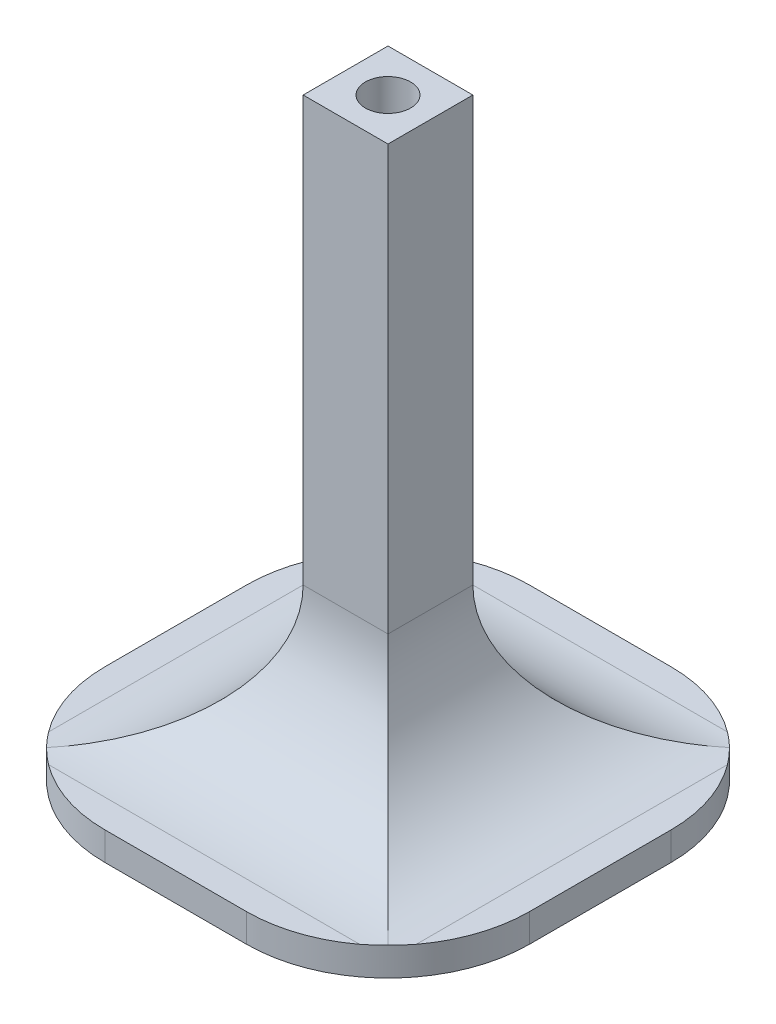
ISO-10303-21;
HEADER;
FILE_DESCRIPTION(('STEP AP214'),'2;1');
FILE_NAME('part.step','',(''),(''),'','','');
FILE_SCHEMA(('AUTOMOTIVE_DESIGN { 1 0 10303 214 1 1 1 1 }'));
ENDSEC;
DATA;
#1=APPLICATION_CONTEXT('core data for automotive mechanical design processes');
#2=APPLICATION_PROTOCOL_DEFINITION('international standard','automotive_design',2000,#1);
#3=PRODUCT_CONTEXT('',#1,'mechanical');
#4=PRODUCT('Part','Part','',(#3));
#5=PRODUCT_RELATED_PRODUCT_CATEGORY('part','',(#4));
#6=PRODUCT_DEFINITION_FORMATION('','',#4);
#7=PRODUCT_DEFINITION_CONTEXT('part definition',#1,'design');
#8=PRODUCT_DEFINITION('design','',#6,#7);
#9=PRODUCT_DEFINITION_SHAPE('','',#8);
#10=(LENGTH_UNIT() NAMED_UNIT(*) SI_UNIT(.MILLI.,.METRE.));
#11=(NAMED_UNIT(*) PLANE_ANGLE_UNIT() SI_UNIT($,.RADIAN.));
#12=(NAMED_UNIT(*) SI_UNIT($,.STERADIAN.) SOLID_ANGLE_UNIT());
#13=UNCERTAINTY_MEASURE_WITH_UNIT(LENGTH_MEASURE(1.E-05),#10,'distance_accuracy_value','');
#14=(GEOMETRIC_REPRESENTATION_CONTEXT(3) GLOBAL_UNCERTAINTY_ASSIGNED_CONTEXT((#13)) GLOBAL_UNIT_ASSIGNED_CONTEXT((#10,
#11,#12)) REPRESENTATION_CONTEXT('',''));
#15=CARTESIAN_POINT('',(0.,0.,0.));
#16=DIRECTION('',(0.,0.,1.));
#17=DIRECTION('',(1.,0.,0.));
#18=AXIS2_PLACEMENT_3D('',#15,#16,#17);
#19=CARTESIAN_POINT('',(0.,2.,0.));
#20=DIRECTION('',(0.,-1.,0.));
#21=DIRECTION('',(0.,0.,-1.));
#22=AXIS2_PLACEMENT_3D('',#19,#20,#21);
#23=PLANE('',#22);
#24=DIRECTION('',(0.,0.,-1.));
#25=VECTOR('',#24,1.);
#26=CARTESIAN_POINT('',(28.,2.,-12.));
#27=LINE('',#26,#25);
#28=CARTESIAN_POINT('',(28.,2.,-26.));
#29=VERTEX_POINT('',#28);
#30=CARTESIAN_POINT('',(28.,2.,-4.00000000000001));
#31=VERTEX_POINT('',#30);
#32=EDGE_CURVE('E303',#29,#31,#27,.F.);
#33=ORIENTED_EDGE('',*,*,#32,.T.);
#34=CARTESIAN_POINT('',(20.,2.,-10.));
#35=DIRECTION('',(0.,-1.,0.));
#36=DIRECTION('',(0.,0.,-1.));
#37=AXIS2_PLACEMENT_3D('',#34,#35,#36);
#38=CIRCLE('',#37,10.);
#39=CARTESIAN_POINT('',(30.,2.,-10.));
#40=VERTEX_POINT('',#39);
#41=EDGE_CURVE('E281',#31,#40,#38,.F.);
#42=ORIENTED_EDGE('',*,*,#41,.T.);
#43=DIRECTION('',(0.,0.,-1.));
#44=VECTOR('',#43,1.);
#45=CARTESIAN_POINT('',(30.,2.,0.));
#46=LINE('',#45,#44);
#47=CARTESIAN_POINT('',(30.,2.,-20.));
#48=VERTEX_POINT('',#47);
#49=EDGE_CURVE('E221',#40,#48,#46,.T.);
#50=ORIENTED_EDGE('',*,*,#49,.T.);
#51=CARTESIAN_POINT('',(20.,2.,-20.));
#52=DIRECTION('',(0.,-1.,0.));
#53=DIRECTION('',(0.,0.,-1.));
#54=AXIS2_PLACEMENT_3D('',#51,#52,#53);
#55=CIRCLE('',#54,10.);
#56=EDGE_CURVE('E297',#48,#29,#55,.F.);
#57=ORIENTED_EDGE('',*,*,#56,.T.);
#58=EDGE_LOOP('',(#33,#42,#50,#57));
#59=FACE_BOUND('',#58,.T.);
#60=ADVANCED_FACE('F39',(#59),#23,.F.);
#61=CARTESIAN_POINT('',(20.,2.,0.));
#62=VERTEX_POINT('',#61);
#63=CARTESIAN_POINT('',(26.,2.,-2.));
#64=VERTEX_POINT('',#63);
#65=EDGE_CURVE('E282',#62,#64,#38,.F.);
#66=ORIENTED_EDGE('',*,*,#65,.T.);
#67=DIRECTION('',(1.,0.,0.));
#68=VECTOR('',#67,1.);
#69=CARTESIAN_POINT('',(2.,2.,-2.));
#70=LINE('',#69,#68);
#71=CARTESIAN_POINT('',(3.99999999999999,2.,-2.));
#72=VERTEX_POINT('',#71);
#73=EDGE_CURVE('E478',#64,#72,#70,.F.);
#74=ORIENTED_EDGE('',*,*,#73,.T.);
#75=CARTESIAN_POINT('',(10.,2.,-10.));
#76=DIRECTION('',(0.,-1.,0.));
#77=DIRECTION('',(0.,0.,-1.));
#78=AXIS2_PLACEMENT_3D('',#75,#76,#77);
#79=CIRCLE('',#78,10.);
#80=CARTESIAN_POINT('',(10.,2.,0.));
#81=VERTEX_POINT('',#80);
#82=EDGE_CURVE('E249',#72,#81,#79,.F.);
#83=ORIENTED_EDGE('',*,*,#82,.T.);
#84=DIRECTION('',(1.,0.,0.));
#85=VECTOR('',#84,1.);
#86=CARTESIAN_POINT('',(0.,2.,0.));
#87=LINE('',#86,#85);
#88=EDGE_CURVE('E216',#81,#62,#87,.T.);
#89=ORIENTED_EDGE('',*,*,#88,.T.);
#90=EDGE_LOOP('',(#66,#74,#83,#89));
#91=FACE_BOUND('',#90,.T.);
#92=ADVANCED_FACE('F460',(#91),#23,.F.);
#93=CARTESIAN_POINT('',(0.,2.,-10.));
#94=VERTEX_POINT('',#93);
#95=CARTESIAN_POINT('',(2.,2.,-4.));
#96=VERTEX_POINT('',#95);
#97=EDGE_CURVE('E250',#94,#96,#79,.F.);
#98=ORIENTED_EDGE('',*,*,#97,.T.);
#99=DIRECTION('',(0.,0.,1.));
#100=VECTOR('',#99,1.);
#101=CARTESIAN_POINT('',(2.,2.,-18.));
#102=LINE('',#101,#100);
#103=CARTESIAN_POINT('',(2.,2.,-26.));
#104=VERTEX_POINT('',#103);
#105=EDGE_CURVE('E310',#96,#104,#102,.F.);
#106=ORIENTED_EDGE('',*,*,#105,.T.);
#107=CARTESIAN_POINT('',(10.,2.,-20.));
#108=DIRECTION('',(0.,-1.,0.));
#109=DIRECTION('',(0.,0.,-1.));
#110=AXIS2_PLACEMENT_3D('',#107,#108,#109);
#111=CIRCLE('',#110,10.);
#112=CARTESIAN_POINT('',(0.,2.,-20.));
#113=VERTEX_POINT('',#112);
#114=EDGE_CURVE('E266',#104,#113,#111,.F.);
#115=ORIENTED_EDGE('',*,*,#114,.T.);
#116=DIRECTION('',(0.,0.,1.));
#117=VECTOR('',#116,1.);
#118=CARTESIAN_POINT('',(0.,2.,0.));
#119=LINE('',#118,#117);
#120=EDGE_CURVE('E213',#113,#94,#119,.T.);
#121=ORIENTED_EDGE('',*,*,#120,.T.);
#122=EDGE_LOOP('',(#98,#106,#115,#121));
#123=FACE_BOUND('',#122,.T.);
#124=ADVANCED_FACE('F432',(#123),#23,.F.);
#125=CARTESIAN_POINT('',(10.,2.,-30.));
#126=VERTEX_POINT('',#125);
#127=CARTESIAN_POINT('',(4.00000000000001,2.,-28.));
#128=VERTEX_POINT('',#127);
#129=EDGE_CURVE('E267',#126,#128,#111,.F.);
#130=ORIENTED_EDGE('',*,*,#129,.T.);
#131=DIRECTION('',(-1.,0.,0.));
#132=VECTOR('',#131,1.);
#133=CARTESIAN_POINT('',(28.,2.,-28.));
#134=LINE('',#133,#132);
#135=CARTESIAN_POINT('',(26.,2.,-28.));
#136=VERTEX_POINT('',#135);
#137=EDGE_CURVE('E316',#128,#136,#134,.F.);
#138=ORIENTED_EDGE('',*,*,#137,.T.);
#139=CARTESIAN_POINT('',(20.,2.,-30.));
#140=VERTEX_POINT('',#139);
#141=EDGE_CURVE('E296',#136,#140,#55,.F.);
#142=ORIENTED_EDGE('',*,*,#141,.T.);
#143=DIRECTION('',(-1.,0.,0.));
#144=VECTOR('',#143,1.);
#145=CARTESIAN_POINT('',(0.,2.,-30.));
#146=LINE('',#145,#144);
#147=EDGE_CURVE('E225',#140,#126,#146,.T.);
#148=ORIENTED_EDGE('',*,*,#147,.T.);
#149=EDGE_LOOP('',(#130,#138,#142,#148));
#150=FACE_BOUND('',#149,.T.);
#151=ADVANCED_FACE('F413',(#150),#23,.F.);
#152=CARTESIAN_POINT('',(0.,2.,0.));
#153=DIRECTION('',(1.,0.,0.));
#154=DIRECTION('',(0.,0.,-1.));
#155=AXIS2_PLACEMENT_3D('',#152,#153,#154);
#156=PLANE('',#155);
#157=ORIENTED_EDGE('',*,*,#120,.F.);
#158=DIRECTION('',(0.,-1.,0.));
#159=VECTOR('',#158,1.);
#160=CARTESIAN_POINT('',(0.,2.,-20.));
#161=LINE('',#160,#159);
#162=CARTESIAN_POINT('',(0.,0.,-20.));
#163=VERTEX_POINT('',#162);
#164=EDGE_CURVE('E254',#113,#163,#161,.T.);
#165=ORIENTED_EDGE('',*,*,#164,.T.);
#166=DIRECTION('',(0.,0.,1.));
#167=VECTOR('',#166,1.);
#168=CARTESIAN_POINT('',(0.,0.,0.));
#169=LINE('',#168,#167);
#170=CARTESIAN_POINT('',(0.,0.,-10.));
#171=VERTEX_POINT('',#170);
#172=EDGE_CURVE('E203',#163,#171,#169,.T.);
#173=ORIENTED_EDGE('',*,*,#172,.T.);
#174=DIRECTION('',(0.,-1.,0.));
#175=VECTOR('',#174,1.);
#176=CARTESIAN_POINT('',(0.,2.,-10.));
#177=LINE('',#176,#175);
#178=EDGE_CURVE('E245',#171,#94,#177,.F.);
#179=ORIENTED_EDGE('',*,*,#178,.T.);
#180=EDGE_LOOP('',(#157,#165,#173,#179));
#181=FACE_BOUND('',#180,.T.);
#182=ADVANCED_FACE('F408',(#181),#156,.F.);
#183=CARTESIAN_POINT('',(0.,2.,0.));
#184=DIRECTION('',(0.,0.,-1.));
#185=DIRECTION('',(-1.,0.,0.));
#186=AXIS2_PLACEMENT_3D('',#183,#184,#185);
#187=PLANE('',#186);
#188=DIRECTION('',(1.,0.,0.));
#189=VECTOR('',#188,1.);
#190=CARTESIAN_POINT('',(0.,0.,0.));
#191=LINE('',#190,#189);
#192=CARTESIAN_POINT('',(10.,0.,0.));
#193=VERTEX_POINT('',#192);
#194=CARTESIAN_POINT('',(20.,0.,0.));
#195=VERTEX_POINT('',#194);
#196=EDGE_CURVE('E207',#193,#195,#191,.T.);
#197=ORIENTED_EDGE('',*,*,#196,.T.);
#198=DIRECTION('',(0.,-1.,0.));
#199=VECTOR('',#198,1.);
#200=CARTESIAN_POINT('',(20.,2.,0.));
#201=LINE('',#200,#199);
#202=EDGE_CURVE('E278',#195,#62,#201,.F.);
#203=ORIENTED_EDGE('',*,*,#202,.T.);
#204=ORIENTED_EDGE('',*,*,#88,.F.);
#205=DIRECTION('',(0.,-1.,0.));
#206=VECTOR('',#205,1.);
#207=CARTESIAN_POINT('',(10.,2.,0.));
#208=LINE('',#207,#206);
#209=EDGE_CURVE('E227',#81,#193,#208,.T.);
#210=ORIENTED_EDGE('',*,*,#209,.T.);
#211=EDGE_LOOP('',(#197,#203,#204,#210));
#212=FACE_BOUND('',#211,.T.);
#213=ADVANCED_FACE('F412',(#212),#187,.F.);
#214=CARTESIAN_POINT('',(30.,2.,0.));
#215=DIRECTION('',(-1.,0.,0.));
#216=DIRECTION('',(0.,0.,1.));
#217=AXIS2_PLACEMENT_3D('',#214,#215,#216);
#218=PLANE('',#217);
#219=DIRECTION('',(0.,0.,-1.));
#220=VECTOR('',#219,1.);
#221=CARTESIAN_POINT('',(30.,0.,0.));
#222=LINE('',#221,#220);
#223=CARTESIAN_POINT('',(30.,0.,-10.));
#224=VERTEX_POINT('',#223);
#225=CARTESIAN_POINT('',(30.,0.,-20.));
#226=VERTEX_POINT('',#225);
#227=EDGE_CURVE('E232',#224,#226,#222,.T.);
#228=ORIENTED_EDGE('',*,*,#227,.T.);
#229=DIRECTION('',(0.,-1.,0.));
#230=VECTOR('',#229,1.);
#231=CARTESIAN_POINT('',(30.,2.,-20.));
#232=LINE('',#231,#230);
#233=EDGE_CURVE('E293',#226,#48,#232,.F.);
#234=ORIENTED_EDGE('',*,*,#233,.T.);
#235=ORIENTED_EDGE('',*,*,#49,.F.);
#236=DIRECTION('',(0.,-1.,0.));
#237=VECTOR('',#236,1.);
#238=CARTESIAN_POINT('',(30.,2.,-10.));
#239=LINE('',#238,#237);
#240=EDGE_CURVE('E271',#40,#224,#239,.T.);
#241=ORIENTED_EDGE('',*,*,#240,.T.);
#242=EDGE_LOOP('',(#228,#234,#235,#241));
#243=FACE_BOUND('',#242,.T.);
#244=ADVANCED_FACE('F417',(#243),#218,.F.);
#245=CARTESIAN_POINT('',(0.,2.,-30.));
#246=DIRECTION('',(0.,0.,1.));
#247=DIRECTION('',(1.,0.,0.));
#248=AXIS2_PLACEMENT_3D('',#245,#246,#247);
#249=PLANE('',#248);
#250=ORIENTED_EDGE('',*,*,#147,.F.);
#251=DIRECTION('',(0.,-1.,0.));
#252=VECTOR('',#251,1.);
#253=CARTESIAN_POINT('',(20.,2.,-30.));
#254=LINE('',#253,#252);
#255=CARTESIAN_POINT('',(20.,0.,-30.));
#256=VERTEX_POINT('',#255);
#257=EDGE_CURVE('E286',#140,#256,#254,.T.);
#258=ORIENTED_EDGE('',*,*,#257,.T.);
#259=DIRECTION('',(-1.,0.,0.));
#260=VECTOR('',#259,1.);
#261=CARTESIAN_POINT('',(0.,0.,-30.));
#262=LINE('',#261,#260);
#263=CARTESIAN_POINT('',(10.,0.,-30.));
#264=VERTEX_POINT('',#263);
#265=EDGE_CURVE('E217',#256,#264,#262,.T.);
#266=ORIENTED_EDGE('',*,*,#265,.T.);
#267=DIRECTION('',(0.,-1.,0.));
#268=VECTOR('',#267,1.);
#269=CARTESIAN_POINT('',(10.,2.,-30.));
#270=LINE('',#269,#268);
#271=EDGE_CURVE('E262',#264,#126,#270,.F.);
#272=ORIENTED_EDGE('',*,*,#271,.T.);
#273=EDGE_LOOP('',(#250,#258,#266,#272));
#274=FACE_BOUND('',#273,.T.);
#275=ADVANCED_FACE('F421',(#274),#249,.F.);
#276=CARTESIAN_POINT('',(0.,0.,0.));
#277=DIRECTION('',(0.,-1.,0.));
#278=DIRECTION('',(0.,0.,-1.));
#279=AXIS2_PLACEMENT_3D('',#276,#277,#278);
#280=PLANE('',#279);
#281=ORIENTED_EDGE('',*,*,#265,.F.);
#282=CARTESIAN_POINT('',(20.,0.,-20.));
#283=DIRECTION('',(0.,-1.,0.));
#284=DIRECTION('',(0.,0.,-1.));
#285=AXIS2_PLACEMENT_3D('',#282,#283,#284);
#286=CIRCLE('',#285,10.);
#287=EDGE_CURVE('E290',#256,#226,#286,.T.);
#288=ORIENTED_EDGE('',*,*,#287,.T.);
#289=ORIENTED_EDGE('',*,*,#227,.F.);
#290=CARTESIAN_POINT('',(20.,0.,-10.));
#291=DIRECTION('',(0.,-1.,0.));
#292=DIRECTION('',(0.,0.,-1.));
#293=AXIS2_PLACEMENT_3D('',#290,#291,#292);
#294=CIRCLE('',#293,10.);
#295=EDGE_CURVE('E275',#224,#195,#294,.T.);
#296=ORIENTED_EDGE('',*,*,#295,.T.);
#297=ORIENTED_EDGE('',*,*,#196,.F.);
#298=CARTESIAN_POINT('',(10.,0.,-10.));
#299=DIRECTION('',(0.,-1.,0.));
#300=DIRECTION('',(0.,0.,-1.));
#301=AXIS2_PLACEMENT_3D('',#298,#299,#300);
#302=CIRCLE('',#301,10.);
#303=EDGE_CURVE('E241',#193,#171,#302,.T.);
#304=ORIENTED_EDGE('',*,*,#303,.T.);
#305=ORIENTED_EDGE('',*,*,#172,.F.);
#306=CARTESIAN_POINT('',(10.,0.,-20.));
#307=DIRECTION('',(0.,-1.,0.));
#308=DIRECTION('',(0.,0.,-1.));
#309=AXIS2_PLACEMENT_3D('',#306,#307,#308);
#310=CIRCLE('',#309,10.);
#311=EDGE_CURVE('E258',#163,#264,#310,.T.);
#312=ORIENTED_EDGE('',*,*,#311,.T.);
#313=EDGE_LOOP('',(#281,#288,#289,#296,#297,#304,#305,#312));
#314=FACE_BOUND('',#313,.T.);
#315=ADVANCED_FACE('F425',(#314),#280,.T.);
#316=CARTESIAN_POINT('',(18.,42.,-12.));
#317=DIRECTION('',(-1.,0.,0.));
#318=DIRECTION('',(0.,0.,1.));
#319=AXIS2_PLACEMENT_3D('',#316,#317,#318);
#320=PLANE('',#319);
#321=DIRECTION('',(0.,-1.,0.));
#322=VECTOR('',#321,1.);
#323=CARTESIAN_POINT('',(18.,42.,-12.));
#324=LINE('',#323,#322);
#325=CARTESIAN_POINT('',(18.,42.,-12.));
#326=VERTEX_POINT('',#325);
#327=CARTESIAN_POINT('',(18.,12.,-12.));
#328=VERTEX_POINT('',#327);
#329=EDGE_CURVE('E495',#326,#328,#324,.T.);
#330=ORIENTED_EDGE('',*,*,#329,.T.);
#331=DIRECTION('',(0.,0.,-1.));
#332=VECTOR('',#331,1.);
#333=CARTESIAN_POINT('',(18.,12.,-18.));
#334=LINE('',#333,#332);
#335=CARTESIAN_POINT('',(18.,12.,-18.));
#336=VERTEX_POINT('',#335);
#337=EDGE_CURVE('E201',#328,#336,#334,.T.);
#338=ORIENTED_EDGE('',*,*,#337,.T.);
#339=DIRECTION('',(0.,-1.,0.));
#340=VECTOR('',#339,1.);
#341=CARTESIAN_POINT('',(18.,42.,-18.));
#342=LINE('',#341,#340);
#343=CARTESIAN_POINT('',(18.,42.,-18.));
#344=VERTEX_POINT('',#343);
#345=EDGE_CURVE('E179',#344,#336,#342,.T.);
#346=ORIENTED_EDGE('',*,*,#345,.F.);
#347=DIRECTION('',(0.,0.,-1.));
#348=VECTOR('',#347,1.);
#349=CARTESIAN_POINT('',(18.,42.,-12.));
#350=LINE('',#349,#348);
#351=EDGE_CURVE('E187',#326,#344,#350,.T.);
#352=ORIENTED_EDGE('',*,*,#351,.F.);
#353=EDGE_LOOP('',(#330,#338,#346,#352));
#354=FACE_BOUND('',#353,.T.);
#355=ADVANCED_FACE('F200',(#354),#320,.F.);
#356=CARTESIAN_POINT('',(12.,42.,-18.));
#357=DIRECTION('',(0.,0.,1.));
#358=DIRECTION('',(1.,0.,0.));
#359=AXIS2_PLACEMENT_3D('',#356,#357,#358);
#360=PLANE('',#359);
#361=ORIENTED_EDGE('',*,*,#345,.T.);
#362=DIRECTION('',(-1.,0.,0.));
#363=VECTOR('',#362,1.);
#364=CARTESIAN_POINT('',(2.,12.,-18.));
#365=LINE('',#364,#363);
#366=CARTESIAN_POINT('',(12.,12.,-18.));
#367=VERTEX_POINT('',#366);
#368=EDGE_CURVE('E313',#336,#367,#365,.T.);
#369=ORIENTED_EDGE('',*,*,#368,.T.);
#370=DIRECTION('',(0.,-1.,0.));
#371=VECTOR('',#370,1.);
#372=CARTESIAN_POINT('',(12.,42.,-18.));
#373=LINE('',#372,#371);
#374=CARTESIAN_POINT('',(12.,42.,-18.));
#375=VERTEX_POINT('',#374);
#376=EDGE_CURVE('E182',#375,#367,#373,.T.);
#377=ORIENTED_EDGE('',*,*,#376,.F.);
#378=DIRECTION('',(-1.,0.,0.));
#379=VECTOR('',#378,1.);
#380=CARTESIAN_POINT('',(12.,42.,-18.));
#381=LINE('',#380,#379);
#382=EDGE_CURVE('E174',#344,#375,#381,.T.);
#383=ORIENTED_EDGE('',*,*,#382,.F.);
#384=EDGE_LOOP('',(#361,#369,#377,#383));
#385=FACE_BOUND('',#384,.T.);
#386=ADVANCED_FACE('F176',(#385),#360,.F.);
#387=CARTESIAN_POINT('',(12.,42.,-12.));
#388=DIRECTION('',(1.,0.,0.));
#389=DIRECTION('',(0.,0.,-1.));
#390=AXIS2_PLACEMENT_3D('',#387,#388,#389);
#391=PLANE('',#390);
#392=ORIENTED_EDGE('',*,*,#376,.T.);
#393=DIRECTION('',(0.,0.,1.));
#394=VECTOR('',#393,1.);
#395=CARTESIAN_POINT('',(12.,12.,-12.));
#396=LINE('',#395,#394);
#397=CARTESIAN_POINT('',(12.,12.,-12.));
#398=VERTEX_POINT('',#397);
#399=EDGE_CURVE('E306',#367,#398,#396,.T.);
#400=ORIENTED_EDGE('',*,*,#399,.T.);
#401=DIRECTION('',(0.,-1.,0.));
#402=VECTOR('',#401,1.);
#403=CARTESIAN_POINT('',(12.,42.,-12.));
#404=LINE('',#403,#402);
#405=CARTESIAN_POINT('',(12.,42.,-12.));
#406=VERTEX_POINT('',#405);
#407=EDGE_CURVE('E209',#406,#398,#404,.T.);
#408=ORIENTED_EDGE('',*,*,#407,.F.);
#409=DIRECTION('',(0.,0.,1.));
#410=VECTOR('',#409,1.);
#411=CARTESIAN_POINT('',(12.,42.,-12.));
#412=LINE('',#411,#410);
#413=EDGE_CURVE('E186',#375,#406,#412,.T.);
#414=ORIENTED_EDGE('',*,*,#413,.F.);
#415=EDGE_LOOP('',(#392,#400,#408,#414));
#416=FACE_BOUND('',#415,.T.);
#417=ADVANCED_FACE('F438',(#416),#391,.F.);
#418=CARTESIAN_POINT('',(12.,42.,-12.));
#419=DIRECTION('',(0.,0.,-1.));
#420=DIRECTION('',(-1.,0.,0.));
#421=AXIS2_PLACEMENT_3D('',#418,#419,#420);
#422=PLANE('',#421);
#423=ORIENTED_EDGE('',*,*,#407,.T.);
#424=DIRECTION('',(1.,0.,0.));
#425=VECTOR('',#424,1.);
#426=CARTESIAN_POINT('',(28.,12.,-12.));
#427=LINE('',#426,#425);
#428=EDGE_CURVE('E371',#398,#328,#427,.T.);
#429=ORIENTED_EDGE('',*,*,#428,.T.);
#430=ORIENTED_EDGE('',*,*,#329,.F.);
#431=DIRECTION('',(1.,0.,0.));
#432=VECTOR('',#431,1.);
#433=CARTESIAN_POINT('',(12.,42.,-12.));
#434=LINE('',#433,#432);
#435=EDGE_CURVE('E192',#406,#326,#434,.T.);
#436=ORIENTED_EDGE('',*,*,#435,.F.);
#437=EDGE_LOOP('',(#423,#429,#430,#436));
#438=FACE_BOUND('',#437,.T.);
#439=ADVANCED_FACE('F441',(#438),#422,.F.);
#440=CARTESIAN_POINT('',(0.,42.,0.));
#441=DIRECTION('',(0.,-1.,0.));
#442=DIRECTION('',(0.,0.,-1.));
#443=AXIS2_PLACEMENT_3D('',#440,#441,#442);
#444=PLANE('',#443);
#445=CARTESIAN_POINT('',(15.,42.,-15.));
#446=DIRECTION('',(0.,1.,0.));
#447=DIRECTION('',(0.,0.,1.));
#448=AXIS2_PLACEMENT_3D('',#445,#446,#447);
#449=CIRCLE('',#448,1.6);
#450=CARTESIAN_POINT('',(15.,42.,-13.4));
#451=VERTEX_POINT('',#450);
#452=EDGE_CURVE('E521',#451,#451,#449,.T.);
#453=ORIENTED_EDGE('',*,*,#452,.F.);
#454=EDGE_LOOP('',(#453));
#455=FACE_BOUND('',#454,.T.);
#456=ORIENTED_EDGE('',*,*,#351,.T.);
#457=ORIENTED_EDGE('',*,*,#382,.T.);
#458=ORIENTED_EDGE('',*,*,#413,.T.);
#459=ORIENTED_EDGE('',*,*,#435,.T.);
#460=EDGE_LOOP('',(#456,#457,#458,#459));
#461=FACE_BOUND('',#460,.T.);
#462=ADVANCED_FACE('F190',(#455,#461),#444,.F.);
#463=CARTESIAN_POINT('',(10.,2.,-10.));
#464=DIRECTION('',(0.,-1.,0.));
#465=DIRECTION('',(0.,0.,-1.));
#466=AXIS2_PLACEMENT_3D('',#463,#464,#465);
#467=CYLINDRICAL_SURFACE('',#466,10.);
#468=ORIENTED_EDGE('',*,*,#97,.F.);
#469=ORIENTED_EDGE('',*,*,#178,.F.);
#470=ORIENTED_EDGE('',*,*,#303,.F.);
#471=ORIENTED_EDGE('',*,*,#209,.F.);
#472=ORIENTED_EDGE('',*,*,#82,.F.);
#473=CARTESIAN_POINT('',(3.99999999999999,2.,-2.));
#474=CARTESIAN_POINT('',(3.81281477685043,2.00000392128931,-2.14035542208783));
#475=CARTESIAN_POINT('',(3.63054897202106,2.00295596237277,-2.28735293146828));
#476=CARTESIAN_POINT('',(3.2780510543001,2.01641216405951,-2.59261894314296));
#477=CARTESIAN_POINT('',(3.10774968813978,2.02686810222784,-2.75080969204412));
#478=CARTESIAN_POINT('',(2.77894354767471,2.05694715962108,-3.0782844734274));
#479=CARTESIAN_POINT('',(2.6204402669078,2.07657143719985,-3.24756990531896));
#480=CARTESIAN_POINT('',(2.31529073269616,2.12673800651943,-3.59690636356185));
#481=CARTESIAN_POINT('',(2.1687270100679,2.15734948767484,-3.77701945083695));
#482=CARTESIAN_POINT('',(2.02917750003635,2.19421946704391,-3.96129246658913));
#483=B_SPLINE_CURVE_WITH_KNOTS('',3,(#473,#474,#475,#476,#477,#478,#479,#480,#481,#482),
.UNSPECIFIED.,.F.,.F.,(4,2,2,2,4),(0.,0.701793794697732,1.39911756524951,2.09652946148908,
2.79841250473641),.UNSPECIFIED.);
#484=CARTESIAN_POINT('',(2.92893218813452,2.04323923206711,-2.92893218813453));
#485=VERTEX_POINT('',#484);
#486=EDGE_CURVE('E62',#72,#485,#483,.T.);
#487=ORIENTED_EDGE('',*,*,#486,.T.);
#488=CARTESIAN_POINT('',(2.92893218813452,2.04323923206711,-2.92893218813453));
#489=CARTESIAN_POINT('',(2.8453783471527,2.0354439407702,-3.01248312170849));
#490=CARTESIAN_POINT('',(2.76325554425829,2.02884301420563,-3.09757057833332));
#491=CARTESIAN_POINT('',(2.60213437221316,2.01781865877414,-3.27054812197161));
#492=CARTESIAN_POINT('',(2.52313142517151,2.01339192148445,-3.358433732706));
#493=CARTESIAN_POINT('',(2.36825753026681,2.00648230989005,-3.53699178720819));
#494=CARTESIAN_POINT('',(2.29238653675932,2.0039994072468,-3.62766419032824));
#495=CARTESIAN_POINT('',(2.14377808789441,2.00075714772598,-3.8118012484179));
#496=CARTESIAN_POINT('',(2.07104560017652,2.00000043148405,-3.90526996007945));
#497=CARTESIAN_POINT('',(2.,2.,-4.));
#498=B_SPLINE_CURVE_WITH_KNOTS('',3,(#488,#489,#490,#491,#492,#493,#494,#495,#496,#497),
.UNSPECIFIED.,.F.,.F.,(4,2,2,2,4),(0.,0.355222708481465,0.70990319353306,1.0645785077176,
1.41979602407003),.UNSPECIFIED.);
#499=EDGE_CURVE('E11',#96,#485,#498,.F.);
#500=ORIENTED_EDGE('',*,*,#499,.F.);
#501=EDGE_LOOP('',(#468,#469,#470,#471,#472,#487,#500));
#502=FACE_BOUND('',#501,.T.);
#503=ADVANCED_FACE('F404',(#502),#467,.T.);
#504=CARTESIAN_POINT('',(10.,2.,-20.));
#505=DIRECTION('',(0.,-1.,0.));
#506=DIRECTION('',(0.,0.,-1.));
#507=AXIS2_PLACEMENT_3D('',#504,#505,#506);
#508=CYLINDRICAL_SURFACE('',#507,10.);
#509=ORIENTED_EDGE('',*,*,#129,.F.);
#510=ORIENTED_EDGE('',*,*,#271,.F.);
#511=ORIENTED_EDGE('',*,*,#311,.F.);
#512=ORIENTED_EDGE('',*,*,#164,.F.);
#513=ORIENTED_EDGE('',*,*,#114,.F.);
#514=CARTESIAN_POINT('',(2.,2.,-26.));
#515=CARTESIAN_POINT('',(2.07104560017651,2.00000043148405,-26.0947300399205));
#516=CARTESIAN_POINT('',(2.14377808789441,2.00075714772598,-26.1881987515821));
#517=CARTESIAN_POINT('',(2.29238653675932,2.0039994072468,-26.3723358096718));
#518=CARTESIAN_POINT('',(2.36825753026682,2.00648230989005,-26.4630082127918));
#519=CARTESIAN_POINT('',(2.52313142517151,2.01339192148445,-26.641566267294));
#520=CARTESIAN_POINT('',(2.60213437221316,2.01781865877414,-26.7294518780284));
#521=CARTESIAN_POINT('',(2.76325554425829,2.02884301420563,-26.9024294216667));
#522=CARTESIAN_POINT('',(2.8453783471527,2.0354439407702,-26.9875168782915));
#523=CARTESIAN_POINT('',(2.92893218813453,2.04323923206711,-27.0710678118655));
#524=B_SPLINE_CURVE_WITH_KNOTS('',3,(#514,#515,#516,#517,#518,#519,#520,#521,#522,#523),
.UNSPECIFIED.,.F.,.F.,(4,2,2,2,4),(0.,0.35521751635243,0.709892830536977,1.06457331558857,
1.41979602407004),.UNSPECIFIED.);
#525=CARTESIAN_POINT('',(2.92893218813453,2.04323923206711,-27.0710678118655));
#526=VERTEX_POINT('',#525);
#527=EDGE_CURVE('E354',#104,#526,#524,.T.);
#528=ORIENTED_EDGE('',*,*,#527,.T.);
#529=CARTESIAN_POINT('',(4.00000000000001,2.,-28.));
#530=CARTESIAN_POINT('',(3.81281477685044,2.00000392128931,-27.8596445779122));
#531=CARTESIAN_POINT('',(3.63054897202107,2.00295596237277,-27.7126470685317));
#532=CARTESIAN_POINT('',(3.27805105430011,2.01641216405951,-27.4073810568571));
#533=CARTESIAN_POINT('',(3.10774968813979,2.02686810222784,-27.2491903079559));
#534=CARTESIAN_POINT('',(2.77894354767472,2.05694715962108,-26.9217155265726));
#535=CARTESIAN_POINT('',(2.62044026690781,2.07657143719985,-26.7524300946811));
#536=CARTESIAN_POINT('',(2.31529073269617,2.12673800651943,-26.4030936364382));
#537=CARTESIAN_POINT('',(2.16872701006791,2.15734948767484,-26.2229805491631));
#538=CARTESIAN_POINT('',(2.02917750003636,2.19421946704391,-26.0387075334109));
#539=B_SPLINE_CURVE_WITH_KNOTS('',3,(#529,#530,#531,#532,#533,#534,#535,#536,#537,#538),
.UNSPECIFIED.,.F.,.F.,(4,2,2,2,4),(0.,0.701793794697732,1.39911756524951,2.09652946148908,
2.79841250473641),.UNSPECIFIED.);
#540=EDGE_CURVE('E322',#526,#128,#539,.F.);
#541=ORIENTED_EDGE('',*,*,#540,.T.);
#542=EDGE_LOOP('',(#509,#510,#511,#512,#513,#528,#541));
#543=FACE_BOUND('',#542,.T.);
#544=ADVANCED_FACE('F337',(#543),#508,.T.);
#545=CARTESIAN_POINT('',(20.,2.,-10.));
#546=DIRECTION('',(0.,-1.,0.));
#547=DIRECTION('',(0.,0.,-1.));
#548=AXIS2_PLACEMENT_3D('',#545,#546,#547);
#549=CYLINDRICAL_SURFACE('',#548,10.);
#550=ORIENTED_EDGE('',*,*,#65,.F.);
#551=ORIENTED_EDGE('',*,*,#202,.F.);
#552=ORIENTED_EDGE('',*,*,#295,.F.);
#553=ORIENTED_EDGE('',*,*,#240,.F.);
#554=ORIENTED_EDGE('',*,*,#41,.F.);
#555=CARTESIAN_POINT('',(28.,2.,-4.00000000000001));
#556=CARTESIAN_POINT('',(27.9289543998235,2.00000043148405,-3.90526996007946));
#557=CARTESIAN_POINT('',(27.8562219121056,2.00075714772598,-3.81180124841791));
#558=CARTESIAN_POINT('',(27.7076134632407,2.0039994072468,-3.62766419032824));
#559=CARTESIAN_POINT('',(27.6317424697332,2.00648230989005,-3.5369917872082));
#560=CARTESIAN_POINT('',(27.4768685748285,2.01339192148445,-3.358433732706));
#561=CARTESIAN_POINT('',(27.3978656277868,2.01781865877414,-3.27054812197161));
#562=CARTESIAN_POINT('',(27.2367444557417,2.02884301420563,-3.09757057833333));
#563=CARTESIAN_POINT('',(27.1546216528473,2.0354439407702,-3.0124831217085));
#564=CARTESIAN_POINT('',(27.0710678118655,2.04323923206711,-2.92893218813453));
#565=B_SPLINE_CURVE_WITH_KNOTS('',3,(#555,#556,#557,#558,#559,#560,#561,#562,#563,#564),
.UNSPECIFIED.,.F.,.F.,(4,2,2,2,4),(0.,0.355217516352428,0.709892830536975,1.06457331558857,
1.41979602407004),.UNSPECIFIED.);
#566=CARTESIAN_POINT('',(27.0710678118655,2.04323923206711,-2.92893218813453));
#567=VERTEX_POINT('',#566);
#568=EDGE_CURVE('E55',#31,#567,#565,.T.);
#569=ORIENTED_EDGE('',*,*,#568,.T.);
#570=CARTESIAN_POINT('',(26.,2.,-2.));
#571=CARTESIAN_POINT('',(26.1871852231496,2.00000392128931,-2.14035542208783));
#572=CARTESIAN_POINT('',(26.3694510279789,2.00295596237277,-2.28735293146828));
#573=CARTESIAN_POINT('',(26.7219489456999,2.01641216405951,-2.59261894314296));
#574=CARTESIAN_POINT('',(26.8922503118602,2.02686810222784,-2.75080969204412));
#575=CARTESIAN_POINT('',(27.2210564523253,2.05694715962108,-3.0782844734274));
#576=CARTESIAN_POINT('',(27.3795597330922,2.07657143719985,-3.24756990531896));
#577=CARTESIAN_POINT('',(27.6847092673038,2.12673800651943,-3.59690636356185));
#578=CARTESIAN_POINT('',(27.8312729899321,2.15734948767484,-3.77701945083695));
#579=CARTESIAN_POINT('',(27.9708224999637,2.19421946704391,-3.96129246658914));
#580=B_SPLINE_CURVE_WITH_KNOTS('',3,(#570,#571,#572,#573,#574,#575,#576,#577,#578,#579),
.UNSPECIFIED.,.F.,.F.,(4,2,2,2,4),(0.,0.701793794697734,1.39911756524951,2.09652946148908,
2.79841250473642),.UNSPECIFIED.);
#581=EDGE_CURVE('E384',#567,#64,#580,.F.);
#582=ORIENTED_EDGE('',*,*,#581,.T.);
#583=EDGE_LOOP('',(#550,#551,#552,#553,#554,#569,#582));
#584=FACE_BOUND('',#583,.T.);
#585=ADVANCED_FACE('F376',(#584),#549,.T.);
#586=CARTESIAN_POINT('',(20.,2.,-20.));
#587=DIRECTION('',(0.,-1.,0.));
#588=DIRECTION('',(0.,0.,-1.));
#589=AXIS2_PLACEMENT_3D('',#586,#587,#588);
#590=CYLINDRICAL_SURFACE('',#589,10.);
#591=ORIENTED_EDGE('',*,*,#56,.F.);
#592=ORIENTED_EDGE('',*,*,#233,.F.);
#593=ORIENTED_EDGE('',*,*,#287,.F.);
#594=ORIENTED_EDGE('',*,*,#257,.F.);
#595=ORIENTED_EDGE('',*,*,#141,.F.);
#596=CARTESIAN_POINT('',(26.,2.,-28.));
#597=CARTESIAN_POINT('',(26.1871852231496,2.00000392128931,-27.8596445779122));
#598=CARTESIAN_POINT('',(26.3694510279789,2.00295596237277,-27.7126470685317));
#599=CARTESIAN_POINT('',(26.7219489456999,2.01641216405951,-27.4073810568571));
#600=CARTESIAN_POINT('',(26.8922503118602,2.02686810222784,-27.2491903079559));
#601=CARTESIAN_POINT('',(27.2210564523253,2.05694715962108,-26.9217155265726));
#602=CARTESIAN_POINT('',(27.3795597330922,2.07657143719985,-26.7524300946811));
#603=CARTESIAN_POINT('',(27.6847092673038,2.12673800651943,-26.4030936364382));
#604=CARTESIAN_POINT('',(27.8312729899321,2.15734948767484,-26.2229805491631));
#605=CARTESIAN_POINT('',(27.9708224999636,2.1942194670439,-26.0387075334109));
#606=B_SPLINE_CURVE_WITH_KNOTS('',3,(#596,#597,#598,#599,#600,#601,#602,#603,#604,#605),
.UNSPECIFIED.,.F.,.F.,(4,2,2,2,4),(0.,0.701793794697733,1.39911756524951,2.09652946148908,
2.79841250473641),.UNSPECIFIED.);
#607=CARTESIAN_POINT('',(27.0710678118656,2.04323923206712,-27.0710678118654));
#608=VERTEX_POINT('',#607);
#609=EDGE_CURVE('E330',#136,#608,#606,.T.);
#610=ORIENTED_EDGE('',*,*,#609,.T.);
#611=CARTESIAN_POINT('',(27.0710678118656,2.04323923206712,-27.0710678118654));
#612=CARTESIAN_POINT('',(27.1546216528474,2.0354439407702,-26.9875168782914));
#613=CARTESIAN_POINT('',(27.2367444557418,2.02884301420563,-26.9024294216666));
#614=CARTESIAN_POINT('',(27.3978656277869,2.01781865877414,-26.7294518780283));
#615=CARTESIAN_POINT('',(27.4768685748285,2.01339192148445,-26.6415662672939));
#616=CARTESIAN_POINT('',(27.6317424697332,2.00648230989005,-26.4630082127918));
#617=CARTESIAN_POINT('',(27.7076134632407,2.0039994072468,-26.3723358096717));
#618=CARTESIAN_POINT('',(27.8562219121056,2.00075714772598,-26.1881987515821));
#619=CARTESIAN_POINT('',(27.9289543998235,2.00000043148405,-26.0947300399205));
#620=CARTESIAN_POINT('',(28.,2.,-26.));
#621=B_SPLINE_CURVE_WITH_KNOTS('',3,(#611,#612,#613,#614,#615,#616,#617,#618,#619,#620),
.UNSPECIFIED.,.F.,.F.,(4,2,2,2,4),(0.,0.355222708481437,0.709903193533007,1.06457850771752,
1.41979602406992),.UNSPECIFIED.);
#622=EDGE_CURVE('E362',#29,#608,#621,.F.);
#623=ORIENTED_EDGE('',*,*,#622,.F.);
#624=EDGE_LOOP('',(#591,#592,#593,#594,#595,#610,#623));
#625=FACE_BOUND('',#624,.T.);
#626=ADVANCED_FACE('F373',(#625),#590,.T.);
#627=CARTESIAN_POINT('',(28.,12.,-12.));
#628=DIRECTION('',(0.,0.,1.));
#629=DIRECTION('',(1.,0.,0.));
#630=AXIS2_PLACEMENT_3D('',#627,#628,#629);
#631=CYLINDRICAL_SURFACE('',#630,10.);
#632=ORIENTED_EDGE('',*,*,#337,.F.);
#633=CARTESIAN_POINT('',(28.,12.,-2.));
#634=DIRECTION('',(-0.707106781186547,0.,0.707106781186547));
#635=DIRECTION('',(0.707106781186547,0.,0.707106781186547));
#636=AXIS2_PLACEMENT_3D('',#633,#634,#635);
#637=ELLIPSE('',#636,14.1421356237309,10.);
#638=EDGE_CURVE('E69',#328,#567,#637,.T.);
#639=ORIENTED_EDGE('',*,*,#638,.T.);
#640=ORIENTED_EDGE('',*,*,#568,.F.);
#641=ORIENTED_EDGE('',*,*,#32,.F.);
#642=ORIENTED_EDGE('',*,*,#622,.T.);
#643=CARTESIAN_POINT('',(28.,12.,-28.));
#644=DIRECTION('',(0.707106781186547,0.,0.707106781186547));
#645=DIRECTION('',(-0.707106781186547,0.,0.707106781186547));
#646=AXIS2_PLACEMENT_3D('',#643,#644,#645);
#647=ELLIPSE('',#646,14.1421356237309,10.);
#648=EDGE_CURVE('E363',#608,#336,#647,.F.);
#649=ORIENTED_EDGE('',*,*,#648,.T.);
#650=EDGE_LOOP('',(#632,#639,#640,#641,#642,#649));
#651=FACE_BOUND('',#650,.T.);
#652=ADVANCED_FACE('F349',(#651),#631,.F.);
#653=CARTESIAN_POINT('',(2.,12.,-12.));
#654=DIRECTION('',(0.,0.,-1.));
#655=DIRECTION('',(-1.,0.,0.));
#656=AXIS2_PLACEMENT_3D('',#653,#654,#655);
#657=CYLINDRICAL_SURFACE('',#656,10.);
#658=ORIENTED_EDGE('',*,*,#399,.F.);
#659=CARTESIAN_POINT('',(2.,12.,-28.));
#660=DIRECTION('',(0.707106781186547,0.,-0.707106781186547));
#661=DIRECTION('',(-0.707106781186547,0.,-0.707106781186547));
#662=AXIS2_PLACEMENT_3D('',#659,#660,#661);
#663=ELLIPSE('',#662,14.1421356237309,10.);
#664=EDGE_CURVE('E319',#367,#526,#663,.T.);
#665=ORIENTED_EDGE('',*,*,#664,.T.);
#666=ORIENTED_EDGE('',*,*,#527,.F.);
#667=ORIENTED_EDGE('',*,*,#105,.F.);
#668=ORIENTED_EDGE('',*,*,#499,.T.);
#669=CARTESIAN_POINT('',(2.,12.,-2.));
#670=DIRECTION('',(-0.707106781186547,0.,-0.707106781186547));
#671=DIRECTION('',(0.707106781186547,0.,-0.707106781186547));
#672=AXIS2_PLACEMENT_3D('',#669,#670,#671);
#673=ELLIPSE('',#672,14.1421356237309,10.);
#674=EDGE_CURVE('E397',#485,#398,#673,.F.);
#675=ORIENTED_EDGE('',*,*,#674,.T.);
#676=EDGE_LOOP('',(#658,#665,#666,#667,#668,#675));
#677=FACE_BOUND('',#676,.T.);
#678=ADVANCED_FACE('F343',(#677),#657,.F.);
#679=CARTESIAN_POINT('',(12.,12.,-28.));
#680=DIRECTION('',(1.,0.,0.));
#681=DIRECTION('',(0.,0.,-1.));
#682=AXIS2_PLACEMENT_3D('',#679,#680,#681);
#683=CYLINDRICAL_SURFACE('',#682,10.);
#684=ORIENTED_EDGE('',*,*,#137,.F.);
#685=ORIENTED_EDGE('',*,*,#540,.F.);
#686=ORIENTED_EDGE('',*,*,#664,.F.);
#687=ORIENTED_EDGE('',*,*,#368,.F.);
#688=ORIENTED_EDGE('',*,*,#648,.F.);
#689=ORIENTED_EDGE('',*,*,#609,.F.);
#690=EDGE_LOOP('',(#684,#685,#686,#687,#688,#689));
#691=FACE_BOUND('',#690,.T.);
#692=ADVANCED_FACE('F340',(#691),#683,.F.);
#693=CARTESIAN_POINT('',(12.,12.,-2.));
#694=DIRECTION('',(-1.,0.,0.));
#695=DIRECTION('',(0.,0.,1.));
#696=AXIS2_PLACEMENT_3D('',#693,#694,#695);
#697=CYLINDRICAL_SURFACE('',#696,10.);
#698=ORIENTED_EDGE('',*,*,#73,.F.);
#699=ORIENTED_EDGE('',*,*,#581,.F.);
#700=ORIENTED_EDGE('',*,*,#638,.F.);
#701=ORIENTED_EDGE('',*,*,#428,.F.);
#702=ORIENTED_EDGE('',*,*,#674,.F.);
#703=ORIENTED_EDGE('',*,*,#486,.F.);
#704=EDGE_LOOP('',(#698,#699,#700,#701,#702,#703));
#705=FACE_BOUND('',#704,.T.);
#706=ADVANCED_FACE('F41',(#705),#697,.F.);
#707=CARTESIAN_POINT('',(15.,34.,-15.));
#708=DIRECTION('',(0.,1.,0.));
#709=DIRECTION('',(0.,0.,1.));
#710=AXIS2_PLACEMENT_3D('',#707,#708,#709);
#711=CYLINDRICAL_SURFACE('',#710,1.6);
#712=CARTESIAN_POINT('',(15.,34.,-15.));
#713=DIRECTION('',(0.,1.,0.));
#714=DIRECTION('',(0.,0.,1.));
#715=AXIS2_PLACEMENT_3D('',#712,#713,#714);
#716=CIRCLE('',#715,1.6);
#717=CARTESIAN_POINT('',(15.,34.,-13.4));
#718=VERTEX_POINT('',#717);
#719=EDGE_CURVE('E197',#718,#718,#716,.T.);
#720=ORIENTED_EDGE('',*,*,#719,.F.);
#721=EDGE_LOOP('',(#720));
#722=FACE_BOUND('',#721,.T.);
#723=ORIENTED_EDGE('',*,*,#452,.T.);
#724=EDGE_LOOP('',(#723));
#725=FACE_BOUND('',#724,.T.);
#726=ADVANCED_FACE('F449',(#722,#725),#711,.F.);
#727=CARTESIAN_POINT('',(15.,34.,-15.));
#728=DIRECTION('',(0.,1.,0.));
#729=DIRECTION('',(0.,0.,1.));
#730=AXIS2_PLACEMENT_3D('',#727,#728,#729);
#731=PLANE('',#730);
#732=ORIENTED_EDGE('',*,*,#719,.T.);
#733=EDGE_LOOP('',(#732));
#734=FACE_BOUND('',#733,.T.);
#735=ADVANCED_FACE('F452',(#734),#731,.T.);
#736=CLOSED_SHELL('',(#60,#92,#124,#151,#182,#213,#244,#275,#315,#355,#386,#417,#439,#462,#503,
#544,#585,#626,#652,#678,#692,#706,#726,#735));
#737=MANIFOLD_SOLID_BREP('B2',#736);
#738=ADVANCED_BREP_SHAPE_REPRESENTATION('',(#18,#737),#14);
#739=SHAPE_DEFINITION_REPRESENTATION(#9,#738);
ENDSEC;
END-ISO-10303-21;
